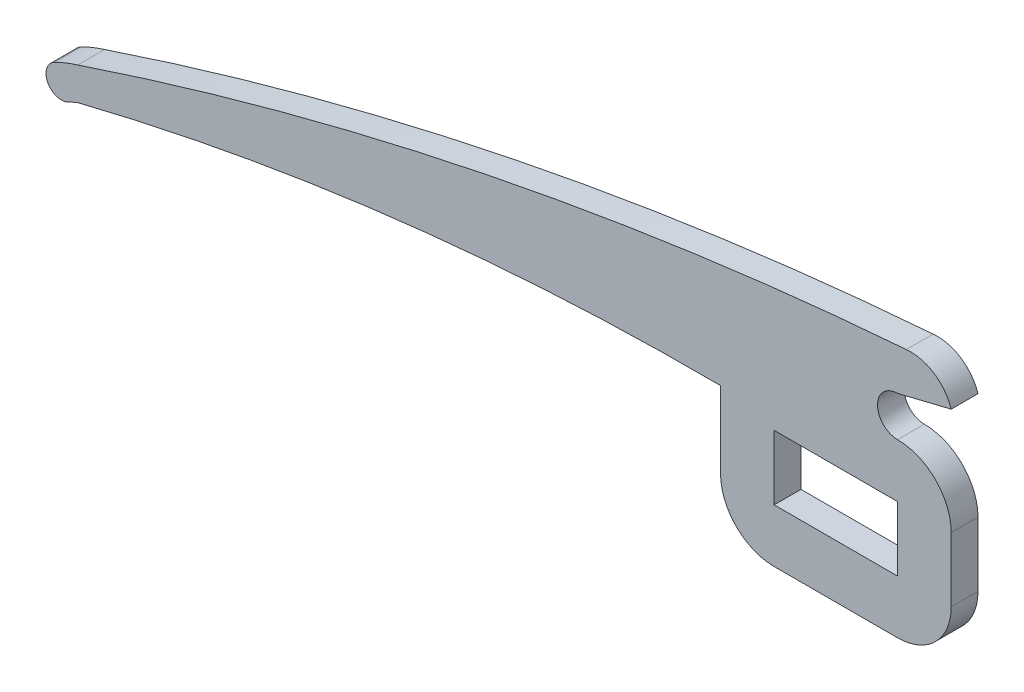
ISO-10303-21;
HEADER;
FILE_DESCRIPTION(('STEP AP214'),'2;1');
FILE_NAME('part.step','',(''),(''),'','','');
FILE_SCHEMA(('AUTOMOTIVE_DESIGN { 1 0 10303 214 1 1 1 1 }'));
ENDSEC;
DATA;
#1=APPLICATION_CONTEXT('core data for automotive mechanical design processes');
#2=APPLICATION_PROTOCOL_DEFINITION('international standard','automotive_design',2000,#1);
#3=PRODUCT_CONTEXT('',#1,'mechanical');
#4=PRODUCT('Part','Part','',(#3));
#5=PRODUCT_RELATED_PRODUCT_CATEGORY('part','',(#4));
#6=PRODUCT_DEFINITION_FORMATION('','',#4);
#7=PRODUCT_DEFINITION_CONTEXT('part definition',#1,'design');
#8=PRODUCT_DEFINITION('design','',#6,#7);
#9=PRODUCT_DEFINITION_SHAPE('','',#8);
#10=(LENGTH_UNIT() NAMED_UNIT(*) SI_UNIT(.MILLI.,.METRE.));
#11=(NAMED_UNIT(*) PLANE_ANGLE_UNIT() SI_UNIT($,.RADIAN.));
#12=(NAMED_UNIT(*) SI_UNIT($,.STERADIAN.) SOLID_ANGLE_UNIT());
#13=UNCERTAINTY_MEASURE_WITH_UNIT(LENGTH_MEASURE(1.E-05),#10,'distance_accuracy_value','');
#14=(GEOMETRIC_REPRESENTATION_CONTEXT(3) GLOBAL_UNCERTAINTY_ASSIGNED_CONTEXT((#13)) GLOBAL_UNIT_ASSIGNED_CONTEXT((#10,
#11,#12)) REPRESENTATION_CONTEXT('',''));
#15=CARTESIAN_POINT('',(0.,0.,0.));
#16=DIRECTION('',(0.,0.,1.));
#17=DIRECTION('',(1.,0.,0.));
#18=AXIS2_PLACEMENT_3D('',#15,#16,#17);
#19=CARTESIAN_POINT('',(-23.0294986436589,0.0187253464755182,5.00000000000001));
#20=DIRECTION('',(0.,0.,-1.));
#21=DIRECTION('',(-1.,0.,0.));
#22=AXIS2_PLACEMENT_3D('',#19,#20,#21);
#23=PLANE('',#22);
#24=CARTESIAN_POINT('',(-23.0294986436589,0.0187253464755182,5.00000000000001));
#25=DIRECTION('',(0.,0.,1.));
#26=DIRECTION('',(-1.,0.,0.));
#27=AXIS2_PLACEMENT_3D('',#24,#25,#26);
#28=CIRCLE('',#27,9.98825294289375);
#29=CARTESIAN_POINT('',(-33.0177515865527,0.0187253464755182,5.00000000000001));
#30=VERTEX_POINT('',#29);
#31=CARTESIAN_POINT('',(-23.0294986436589,-9.96952759641823,5.00000000000001));
#32=VERTEX_POINT('',#31);
#33=EDGE_CURVE('E195',#30,#32,#28,.T.);
#34=ORIENTED_EDGE('',*,*,#33,.T.);
#35=DIRECTION('',(1.,0.,0.));
#36=VECTOR('',#35,1.);
#37=CARTESIAN_POINT('',(-23.0294986436589,-9.96952759641823,5.00000000000001));
#38=LINE('',#37,#36);
#39=CARTESIAN_POINT('',(0.0200590351698439,-9.96952759641824,5.00000000000001));
#40=VERTEX_POINT('',#39);
#41=EDGE_CURVE('E198',#32,#40,#38,.T.);
#42=ORIENTED_EDGE('',*,*,#41,.T.);
#43=CARTESIAN_POINT('',(0.0200590351698421,0.0200440340774669,5.00000000000001));
#44=DIRECTION('',(0.,0.,1.));
#45=DIRECTION('',(-1.,0.,0.));
#46=AXIS2_PLACEMENT_3D('',#43,#44,#45);
#47=CIRCLE('',#46,9.9895716304957);
#48=CARTESIAN_POINT('',(10.0096306656655,0.0200437648131177,5.00000000000001));
#49=VERTEX_POINT('',#48);
#50=EDGE_CURVE('E201',#40,#49,#47,.T.);
#51=ORIENTED_EDGE('',*,*,#50,.T.);
#52=DIRECTION('',(0.,1.,0.));
#53=VECTOR('',#52,1.);
#54=CARTESIAN_POINT('',(10.0096306656655,12.0354295052616,5.00000000000001));
#55=LINE('',#54,#53);
#56=CARTESIAN_POINT('',(10.0096306656655,12.0354295052616,5.00000000000001));
#57=VERTEX_POINT('',#56);
#58=EDGE_CURVE('E203',#49,#57,#55,.T.);
#59=ORIENTED_EDGE('',*,*,#58,.T.);
#60=CARTESIAN_POINT('',(0.00232147007218474,12.0331080349892,5.00000000000001));
#61=DIRECTION('',(0.,0.,1.));
#62=DIRECTION('',(-1.,0.,0.));
#63=AXIS2_PLACEMENT_3D('',#60,#61,#62);
#64=CIRCLE('',#63,10.0073094648578);
#65=CARTESIAN_POINT('',(0.00232147007218495,22.0404174998469,5.00000000000001));
#66=VERTEX_POINT('',#65);
#67=EDGE_CURVE('E205',#57,#66,#64,.T.);
#68=ORIENTED_EDGE('',*,*,#67,.T.);
#69=CARTESIAN_POINT('',(0.00232147007218232,25.7769746913497,5.00000000000001));
#70=DIRECTION('',(0.,0.,-1.));
#71=DIRECTION('',(1.,0.,0.));
#72=AXIS2_PLACEMENT_3D('',#69,#70,#71);
#73=CIRCLE('',#72,3.73655719150275);
#74=CARTESIAN_POINT('',(0.00232147007218474,29.5135318828524,5.00000000000001));
#75=VERTEX_POINT('',#74);
#76=EDGE_CURVE('E207',#66,#75,#73,.T.);
#77=ORIENTED_EDGE('',*,*,#76,.T.);
#78=DIRECTION('',(0.971260967002743,0.238017087573342,0.));
#79=VECTOR('',#78,1.);
#80=CARTESIAN_POINT('',(10.0096306656655,31.9659217863935,5.00000000000001));
#81=LINE('',#80,#79);
#82=CARTESIAN_POINT('',(10.0096306656655,31.9659217863935,5.00000000000001));
#83=VERTEX_POINT('',#82);
#84=EDGE_CURVE('E209',#75,#83,#81,.T.);
#85=ORIENTED_EDGE('',*,*,#84,.T.);
#86=CARTESIAN_POINT('',(2.45471137361272,29.5135318828524,5.00000000000001));
#87=DIRECTION('',(0.,0.,1.));
#88=DIRECTION('',(-1.,0.,0.));
#89=AXIS2_PLACEMENT_3D('',#86,#87,#88);
#90=CIRCLE('',#89,7.94298569483932);
#91=CARTESIAN_POINT('',(1.63153585656594,37.4137473113427,5.00000000000001));
#92=VERTEX_POINT('',#91);
#93=EDGE_CURVE('E211',#83,#92,#90,.T.);
#94=ORIENTED_EDGE('',*,*,#93,.T.);
#95=CARTESIAN_POINT('',(50.6287042659373,-601.67086758297,5.00000000000001));
#96=DIRECTION('',(0.,0.,1.));
#97=DIRECTION('',(-1.,0.,0.));
#98=AXIS2_PLACEMENT_3D('',#95,#96,#97);
#99=CIRCLE('',#98,640.960113818909);
#100=CARTESIAN_POINT('',(-152.922807066753,6.10923224008788,5.00000000000001));
#101=VERTEX_POINT('',#100);
#102=EDGE_CURVE('E213',#92,#101,#99,.T.);
#103=ORIENTED_EDGE('',*,*,#102,.T.);
#104=CARTESIAN_POINT('',(-144.895449134273,-20.1016774209472,5.00000000000001));
#105=DIRECTION('',(0.,0.,1.));
#106=DIRECTION('',(1.,0.,0.));
#107=AXIS2_PLACEMENT_3D('',#104,#105,#106);
#108=CIRCLE('',#107,27.412593103081);
#109=CARTESIAN_POINT('',(-157.265351369066,4.36126964878941,5.00000000000001));
#110=VERTEX_POINT('',#109);
#111=EDGE_CURVE('E215',#101,#110,#108,.T.);
#112=ORIENTED_EDGE('',*,*,#111,.T.);
#113=CARTESIAN_POINT('',(-155.968002489383,1.79560854878484,5.00000000000001));
#114=DIRECTION('',(0.,0.,1.));
#115=DIRECTION('',(1.,0.,0.));
#116=AXIS2_PLACEMENT_3D('',#113,#114,#115);
#117=CIRCLE('',#116,2.87501843397422);
#118=CARTESIAN_POINT('',(-154.6706536097,-0.770052551219726,5.00000000000001));
#119=VERTEX_POINT('',#118);
#120=EDGE_CURVE('E217',#110,#119,#117,.T.);
#121=ORIENTED_EDGE('',*,*,#120,.T.);
#122=CARTESIAN_POINT('',(-144.888159070749,-20.1160943851825,5.00000000000001));
#123=DIRECTION('',(0.,0.,-1.));
#124=DIRECTION('',(-1.,0.,0.));
#125=AXIS2_PLACEMENT_3D('',#122,#123,#124);
#126=CIRCLE('',#125,21.6787115402656);
#127=CARTESIAN_POINT('',(-152.922807066753,0.0187253464755122,5.00000000000001));
#128=VERTEX_POINT('',#127);
#129=EDGE_CURVE('E219',#119,#128,#126,.T.);
#130=ORIENTED_EDGE('',*,*,#129,.T.);
#131=CARTESIAN_POINT('',(-36.4351616334843,-468.822459355462,5.00000000000001));
#132=DIRECTION('',(0.,0.,-1.));
#133=DIRECTION('',(-1.,0.,0.));
#134=AXIS2_PLACEMENT_3D('',#131,#132,#133);
#135=CIRCLE('',#134,483.09567169589);
#136=CARTESIAN_POINT('',(-33.0177515865527,14.2611248407662,5.00000000000001));
#137=VERTEX_POINT('',#136);
#138=EDGE_CURVE('E221',#128,#137,#135,.T.);
#139=ORIENTED_EDGE('',*,*,#138,.T.);
#140=DIRECTION('',(0.,-1.,0.));
#141=VECTOR('',#140,1.);
#142=CARTESIAN_POINT('',(-33.0177515865527,12.0354297745259,5.00000000000001));
#143=LINE('',#142,#141);
#144=EDGE_CURVE('E223',#137,#30,#143,.T.);
#145=ORIENTED_EDGE('',*,*,#144,.T.);
#146=EDGE_LOOP('',(#34,#42,#51,#59,#68,#77,#85,#94,#103,#112,#121,#130,#139,#145));
#147=FACE_BOUND('',#146,.T.);
#148=DIRECTION('',(0.,1.,0.));
#149=VECTOR('',#148,1.);
#150=CARTESIAN_POINT('',(0.,12.0354297745259,5.00000000000001));
#151=LINE('',#150,#149);
#152=CARTESIAN_POINT('',(0.,0.,5.00000000000001));
#153=VERTEX_POINT('',#152);
#154=CARTESIAN_POINT('',(0.,12.0354297745259,5.00000000000001));
#155=VERTEX_POINT('',#154);
#156=EDGE_CURVE('E159',#153,#155,#151,.T.);
#157=ORIENTED_EDGE('',*,*,#156,.F.);
#158=DIRECTION('',(1.,0.,0.));
#159=VECTOR('',#158,1.);
#160=CARTESIAN_POINT('',(0.,0.,5.00000000000001));
#161=LINE('',#160,#159);
#162=CARTESIAN_POINT('',(-23.0107908497502,0.,5.00000000000001));
#163=VERTEX_POINT('',#162);
#164=EDGE_CURVE('E181',#163,#153,#161,.T.);
#165=ORIENTED_EDGE('',*,*,#164,.F.);
#166=DIRECTION('',(0.,-1.,0.));
#167=VECTOR('',#166,1.);
#168=CARTESIAN_POINT('',(-23.0107908497502,0.,5.00000000000001));
#169=LINE('',#168,#167);
#170=CARTESIAN_POINT('',(-23.0107908497502,12.0354297745259,5.00000000000001));
#171=VERTEX_POINT('',#170);
#172=EDGE_CURVE('E179',#171,#163,#169,.T.);
#173=ORIENTED_EDGE('',*,*,#172,.F.);
#174=DIRECTION('',(-1.,0.,0.));
#175=VECTOR('',#174,1.);
#176=CARTESIAN_POINT('',(-23.0107908497502,12.0354297745259,5.00000000000001));
#177=LINE('',#176,#175);
#178=EDGE_CURVE('E167',#155,#171,#177,.T.);
#179=ORIENTED_EDGE('',*,*,#178,.F.);
#180=EDGE_LOOP('',(#157,#165,#173,#179));
#181=FACE_BOUND('',#180,.T.);
#182=ADVANCED_FACE('F34',(#147,#181),#23,.F.);
#183=CARTESIAN_POINT('',(-23.0294986436589,0.0187253464755182,0.));
#184=DIRECTION('',(0.,0.,-1.));
#185=DIRECTION('',(-1.,0.,0.));
#186=AXIS2_PLACEMENT_3D('',#183,#184,#185);
#187=PLANE('',#186);
#188=CARTESIAN_POINT('',(-23.0294986436589,0.0187253464755182,0.));
#189=DIRECTION('',(0.,0.,1.));
#190=DIRECTION('',(-1.,0.,0.));
#191=AXIS2_PLACEMENT_3D('',#188,#189,#190);
#192=CIRCLE('',#191,9.98825294289375);
#193=CARTESIAN_POINT('',(-33.0177515865527,0.0187253464755182,0.));
#194=VERTEX_POINT('',#193);
#195=CARTESIAN_POINT('',(-23.0294986436589,-9.96952759641823,0.));
#196=VERTEX_POINT('',#195);
#197=EDGE_CURVE('E175',#194,#196,#192,.T.);
#198=ORIENTED_EDGE('',*,*,#197,.F.);
#199=DIRECTION('',(0.,-1.,0.));
#200=VECTOR('',#199,1.);
#201=CARTESIAN_POINT('',(-33.0177515865527,12.0354297745259,0.));
#202=LINE('',#201,#200);
#203=CARTESIAN_POINT('',(-33.0177515865527,14.2611248407662,0.));
#204=VERTEX_POINT('',#203);
#205=EDGE_CURVE('E199',#204,#194,#202,.T.);
#206=ORIENTED_EDGE('',*,*,#205,.F.);
#207=CARTESIAN_POINT('',(-36.4351616334843,-468.822459355462,0.));
#208=DIRECTION('',(0.,0.,-1.));
#209=DIRECTION('',(-1.,0.,0.));
#210=AXIS2_PLACEMENT_3D('',#207,#208,#209);
#211=CIRCLE('',#210,483.09567169589);
#212=CARTESIAN_POINT('',(-152.922807066753,0.0187253464755122,0.));
#213=VERTEX_POINT('',#212);
#214=EDGE_CURVE('E250',#213,#204,#211,.T.);
#215=ORIENTED_EDGE('',*,*,#214,.F.);
#216=CARTESIAN_POINT('',(-144.888159070749,-20.1160943851825,0.));
#217=DIRECTION('',(0.,0.,-1.));
#218=DIRECTION('',(-1.,0.,0.));
#219=AXIS2_PLACEMENT_3D('',#216,#217,#218);
#220=CIRCLE('',#219,21.6787115402656);
#221=CARTESIAN_POINT('',(-154.6706536097,-0.770052551219726,0.));
#222=VERTEX_POINT('',#221);
#223=EDGE_CURVE('E248',#222,#213,#220,.T.);
#224=ORIENTED_EDGE('',*,*,#223,.F.);
#225=CARTESIAN_POINT('',(-155.968002489383,1.79560854878484,0.));
#226=DIRECTION('',(0.,0.,1.));
#227=DIRECTION('',(1.,0.,0.));
#228=AXIS2_PLACEMENT_3D('',#225,#226,#227);
#229=CIRCLE('',#228,2.87501843397422);
#230=CARTESIAN_POINT('',(-157.265351369066,4.36126964878941,0.));
#231=VERTEX_POINT('',#230);
#232=EDGE_CURVE('E246',#231,#222,#229,.T.);
#233=ORIENTED_EDGE('',*,*,#232,.F.);
#234=CARTESIAN_POINT('',(-144.895449134273,-20.1016774209472,0.));
#235=DIRECTION('',(0.,0.,1.));
#236=DIRECTION('',(1.,0.,0.));
#237=AXIS2_PLACEMENT_3D('',#234,#235,#236);
#238=CIRCLE('',#237,27.412593103081);
#239=CARTESIAN_POINT('',(-152.922807066753,6.10923224008788,0.));
#240=VERTEX_POINT('',#239);
#241=EDGE_CURVE('E244',#240,#231,#238,.T.);
#242=ORIENTED_EDGE('',*,*,#241,.F.);
#243=CARTESIAN_POINT('',(50.6287042659373,-601.67086758297,0.));
#244=DIRECTION('',(0.,0.,1.));
#245=DIRECTION('',(-1.,0.,0.));
#246=AXIS2_PLACEMENT_3D('',#243,#244,#245);
#247=CIRCLE('',#246,640.960113818909);
#248=CARTESIAN_POINT('',(1.63153585656594,37.4137473113427,0.));
#249=VERTEX_POINT('',#248);
#250=EDGE_CURVE('E242',#249,#240,#247,.T.);
#251=ORIENTED_EDGE('',*,*,#250,.F.);
#252=CARTESIAN_POINT('',(2.45471137361272,29.5135318828524,0.));
#253=DIRECTION('',(0.,0.,1.));
#254=DIRECTION('',(-1.,0.,0.));
#255=AXIS2_PLACEMENT_3D('',#252,#253,#254);
#256=CIRCLE('',#255,7.94298569483932);
#257=CARTESIAN_POINT('',(10.0096306656655,31.9659217863935,0.));
#258=VERTEX_POINT('',#257);
#259=EDGE_CURVE('E240',#258,#249,#256,.T.);
#260=ORIENTED_EDGE('',*,*,#259,.F.);
#261=DIRECTION('',(0.971260967002743,0.238017087573342,0.));
#262=VECTOR('',#261,1.);
#263=CARTESIAN_POINT('',(10.0096306656655,31.9659217863935,0.));
#264=LINE('',#263,#262);
#265=CARTESIAN_POINT('',(0.00232147007218474,29.5135318828524,0.));
#266=VERTEX_POINT('',#265);
#267=EDGE_CURVE('E238',#266,#258,#264,.T.);
#268=ORIENTED_EDGE('',*,*,#267,.F.);
#269=CARTESIAN_POINT('',(0.00232147007218232,25.7769746913497,0.));
#270=DIRECTION('',(0.,0.,-1.));
#271=DIRECTION('',(1.,0.,0.));
#272=AXIS2_PLACEMENT_3D('',#269,#270,#271);
#273=CIRCLE('',#272,3.73655719150275);
#274=CARTESIAN_POINT('',(0.00232147007218495,22.0404174998469,0.));
#275=VERTEX_POINT('',#274);
#276=EDGE_CURVE('E236',#275,#266,#273,.T.);
#277=ORIENTED_EDGE('',*,*,#276,.F.);
#278=CARTESIAN_POINT('',(0.00232147007218474,12.0331080349892,0.));
#279=DIRECTION('',(0.,0.,1.));
#280=DIRECTION('',(-1.,0.,0.));
#281=AXIS2_PLACEMENT_3D('',#278,#279,#280);
#282=CIRCLE('',#281,10.0073094648578);
#283=CARTESIAN_POINT('',(10.0096306656655,12.0354295052616,0.));
#284=VERTEX_POINT('',#283);
#285=EDGE_CURVE('E234',#284,#275,#282,.T.);
#286=ORIENTED_EDGE('',*,*,#285,.F.);
#287=DIRECTION('',(0.,1.,0.));
#288=VECTOR('',#287,1.);
#289=CARTESIAN_POINT('',(10.0096306656655,12.0354295052616,0.));
#290=LINE('',#289,#288);
#291=CARTESIAN_POINT('',(10.0096306656655,0.0200437648131177,0.));
#292=VERTEX_POINT('',#291);
#293=EDGE_CURVE('E232',#292,#284,#290,.T.);
#294=ORIENTED_EDGE('',*,*,#293,.F.);
#295=CARTESIAN_POINT('',(0.0200590351698421,0.0200440340774669,0.));
#296=DIRECTION('',(0.,0.,1.));
#297=DIRECTION('',(-1.,0.,0.));
#298=AXIS2_PLACEMENT_3D('',#295,#296,#297);
#299=CIRCLE('',#298,9.9895716304957);
#300=CARTESIAN_POINT('',(0.0200590351698439,-9.96952759641824,0.));
#301=VERTEX_POINT('',#300);
#302=EDGE_CURVE('E230',#301,#292,#299,.T.);
#303=ORIENTED_EDGE('',*,*,#302,.F.);
#304=DIRECTION('',(1.,0.,0.));
#305=VECTOR('',#304,1.);
#306=CARTESIAN_POINT('',(-23.0294986436589,-9.96952759641823,0.));
#307=LINE('',#306,#305);
#308=EDGE_CURVE('E228',#196,#301,#307,.T.);
#309=ORIENTED_EDGE('',*,*,#308,.F.);
#310=EDGE_LOOP('',(#198,#206,#215,#224,#233,#242,#251,#260,#268,#277,#286,#294,#303,#309));
#311=FACE_BOUND('',#310,.T.);
#312=DIRECTION('',(1.,0.,0.));
#313=VECTOR('',#312,1.);
#314=CARTESIAN_POINT('',(0.,0.,0.));
#315=LINE('',#314,#313);
#316=CARTESIAN_POINT('',(-23.0107908497502,0.,0.));
#317=VERTEX_POINT('',#316);
#318=CARTESIAN_POINT('',(0.,0.,0.));
#319=VERTEX_POINT('',#318);
#320=EDGE_CURVE('E168',#317,#319,#315,.T.);
#321=ORIENTED_EDGE('',*,*,#320,.T.);
#322=DIRECTION('',(0.,1.,0.));
#323=VECTOR('',#322,1.);
#324=CARTESIAN_POINT('',(0.,12.0354297745259,0.));
#325=LINE('',#324,#323);
#326=CARTESIAN_POINT('',(0.,12.0354297745259,0.));
#327=VERTEX_POINT('',#326);
#328=EDGE_CURVE('E57',#319,#327,#325,.T.);
#329=ORIENTED_EDGE('',*,*,#328,.T.);
#330=DIRECTION('',(-1.,0.,0.));
#331=VECTOR('',#330,1.);
#332=CARTESIAN_POINT('',(-23.0107908497502,12.0354297745259,0.));
#333=LINE('',#332,#331);
#334=CARTESIAN_POINT('',(-23.0107908497502,12.0354297745259,0.));
#335=VERTEX_POINT('',#334);
#336=EDGE_CURVE('E174',#327,#335,#333,.T.);
#337=ORIENTED_EDGE('',*,*,#336,.T.);
#338=DIRECTION('',(0.,-1.,0.));
#339=VECTOR('',#338,1.);
#340=CARTESIAN_POINT('',(-23.0107908497502,0.,0.));
#341=LINE('',#340,#339);
#342=EDGE_CURVE('E187',#335,#317,#341,.T.);
#343=ORIENTED_EDGE('',*,*,#342,.T.);
#344=EDGE_LOOP('',(#321,#329,#337,#343));
#345=FACE_BOUND('',#344,.T.);
#346=ADVANCED_FACE('F299',(#311,#345),#187,.T.);
#347=CARTESIAN_POINT('',(-23.0294986436589,0.0187253464755182,5.00000000000001));
#348=DIRECTION('',(0.,0.,-1.));
#349=DIRECTION('',(-1.,0.,0.));
#350=AXIS2_PLACEMENT_3D('',#347,#348,#349);
#351=CYLINDRICAL_SURFACE('',#350,9.98825294289375);
#352=ORIENTED_EDGE('',*,*,#197,.T.);
#353=DIRECTION('',(0.,0.,-1.));
#354=VECTOR('',#353,1.);
#355=CARTESIAN_POINT('',(-23.0294986436589,-9.96952759641823,5.00000000000001));
#356=LINE('',#355,#354);
#357=EDGE_CURVE('E11',#32,#196,#356,.T.);
#358=ORIENTED_EDGE('',*,*,#357,.F.);
#359=ORIENTED_EDGE('',*,*,#33,.F.);
#360=DIRECTION('',(0.,0.,-1.));
#361=VECTOR('',#360,1.);
#362=CARTESIAN_POINT('',(-33.0177515865527,0.0187253464755182,5.00000000000001));
#363=LINE('',#362,#361);
#364=EDGE_CURVE('E225',#30,#194,#363,.T.);
#365=ORIENTED_EDGE('',*,*,#364,.T.);
#366=EDGE_LOOP('',(#352,#358,#359,#365));
#367=FACE_BOUND('',#366,.T.);
#368=ADVANCED_FACE('F36',(#367),#351,.T.);
#369=CARTESIAN_POINT('',(-23.0294986436589,-9.96952759641823,5.00000000000001));
#370=DIRECTION('',(0.,1.,0.));
#371=DIRECTION('',(-1.,0.,0.));
#372=AXIS2_PLACEMENT_3D('',#369,#370,#371);
#373=PLANE('',#372);
#374=ORIENTED_EDGE('',*,*,#308,.T.);
#375=DIRECTION('',(0.,0.,-1.));
#376=VECTOR('',#375,1.);
#377=CARTESIAN_POINT('',(0.0200590351698439,-9.96952759641824,5.00000000000001));
#378=LINE('',#377,#376);
#379=EDGE_CURVE('E42',#40,#301,#378,.T.);
#380=ORIENTED_EDGE('',*,*,#379,.F.);
#381=ORIENTED_EDGE('',*,*,#41,.F.);
#382=ORIENTED_EDGE('',*,*,#357,.T.);
#383=EDGE_LOOP('',(#374,#380,#381,#382));
#384=FACE_BOUND('',#383,.T.);
#385=ADVANCED_FACE('F316',(#384),#373,.F.);
#386=CARTESIAN_POINT('',(0.0200590351698421,0.0200440340774669,5.00000000000001));
#387=DIRECTION('',(0.,0.,-1.));
#388=DIRECTION('',(-1.,0.,0.));
#389=AXIS2_PLACEMENT_3D('',#386,#387,#388);
#390=CYLINDRICAL_SURFACE('',#389,9.9895716304957);
#391=ORIENTED_EDGE('',*,*,#302,.T.);
#392=DIRECTION('',(0.,0.,-1.));
#393=VECTOR('',#392,1.);
#394=CARTESIAN_POINT('',(10.0096306656655,0.0200437648131177,5.00000000000001));
#395=LINE('',#394,#393);
#396=EDGE_CURVE('E286',#49,#292,#395,.T.);
#397=ORIENTED_EDGE('',*,*,#396,.F.);
#398=ORIENTED_EDGE('',*,*,#50,.F.);
#399=ORIENTED_EDGE('',*,*,#379,.T.);
#400=EDGE_LOOP('',(#391,#397,#398,#399));
#401=FACE_BOUND('',#400,.T.);
#402=ADVANCED_FACE('F293',(#401),#390,.T.);
#403=CARTESIAN_POINT('',(10.0096306656655,12.0354295052616,5.00000000000001));
#404=DIRECTION('',(-1.,0.,0.));
#405=DIRECTION('',(0.,0.,1.));
#406=AXIS2_PLACEMENT_3D('',#403,#404,#405);
#407=PLANE('',#406);
#408=ORIENTED_EDGE('',*,*,#293,.T.);
#409=DIRECTION('',(0.,0.,-1.));
#410=VECTOR('',#409,1.);
#411=CARTESIAN_POINT('',(10.0096306656655,12.0354295052616,5.00000000000001));
#412=LINE('',#411,#410);
#413=EDGE_CURVE('E283',#57,#284,#412,.T.);
#414=ORIENTED_EDGE('',*,*,#413,.F.);
#415=ORIENTED_EDGE('',*,*,#58,.F.);
#416=ORIENTED_EDGE('',*,*,#396,.T.);
#417=EDGE_LOOP('',(#408,#414,#415,#416));
#418=FACE_BOUND('',#417,.T.);
#419=ADVANCED_FACE('F305',(#418),#407,.F.);
#420=CARTESIAN_POINT('',(0.00232147007218474,12.0331080349892,5.00000000000001));
#421=DIRECTION('',(0.,0.,-1.));
#422=DIRECTION('',(-1.,0.,0.));
#423=AXIS2_PLACEMENT_3D('',#420,#421,#422);
#424=CYLINDRICAL_SURFACE('',#423,10.0073094648578);
#425=ORIENTED_EDGE('',*,*,#285,.T.);
#426=DIRECTION('',(0.,0.,-1.));
#427=VECTOR('',#426,1.);
#428=CARTESIAN_POINT('',(0.00232147007218495,22.0404174998469,5.00000000000001));
#429=LINE('',#428,#427);
#430=EDGE_CURVE('E280',#66,#275,#429,.T.);
#431=ORIENTED_EDGE('',*,*,#430,.F.);
#432=ORIENTED_EDGE('',*,*,#67,.F.);
#433=ORIENTED_EDGE('',*,*,#413,.T.);
#434=EDGE_LOOP('',(#425,#431,#432,#433));
#435=FACE_BOUND('',#434,.T.);
#436=ADVANCED_FACE('F309',(#435),#424,.T.);
#437=CARTESIAN_POINT('',(0.00232147007218232,25.7769746913497,5.00000000000001));
#438=DIRECTION('',(0.,0.,-1.));
#439=DIRECTION('',(-1.,0.,0.));
#440=AXIS2_PLACEMENT_3D('',#437,#438,#439);
#441=CYLINDRICAL_SURFACE('',#440,3.73655719150275);
#442=ORIENTED_EDGE('',*,*,#276,.T.);
#443=DIRECTION('',(0.,0.,-1.));
#444=VECTOR('',#443,1.);
#445=CARTESIAN_POINT('',(0.00232147007218474,29.5135318828524,5.00000000000001));
#446=LINE('',#445,#444);
#447=EDGE_CURVE('E277',#75,#266,#446,.T.);
#448=ORIENTED_EDGE('',*,*,#447,.F.);
#449=ORIENTED_EDGE('',*,*,#76,.F.);
#450=ORIENTED_EDGE('',*,*,#430,.T.);
#451=EDGE_LOOP('',(#442,#448,#449,#450));
#452=FACE_BOUND('',#451,.T.);
#453=ADVANCED_FACE('F358',(#452),#441,.F.);
#454=CARTESIAN_POINT('',(10.0096306656655,31.9659217863935,5.00000000000001));
#455=DIRECTION('',(-0.238017087573342,0.971260967002743,0.));
#456=DIRECTION('',(-0.971260967002743,-0.238017087573342,0.));
#457=AXIS2_PLACEMENT_3D('',#454,#455,#456);
#458=PLANE('',#457);
#459=ORIENTED_EDGE('',*,*,#267,.T.);
#460=DIRECTION('',(0.,0.,-1.));
#461=VECTOR('',#460,1.);
#462=CARTESIAN_POINT('',(10.0096306656655,31.9659217863935,5.00000000000001));
#463=LINE('',#462,#461);
#464=EDGE_CURVE('E274',#83,#258,#463,.T.);
#465=ORIENTED_EDGE('',*,*,#464,.F.);
#466=ORIENTED_EDGE('',*,*,#84,.F.);
#467=ORIENTED_EDGE('',*,*,#447,.T.);
#468=EDGE_LOOP('',(#459,#465,#466,#467));
#469=FACE_BOUND('',#468,.T.);
#470=ADVANCED_FACE('F356',(#469),#458,.F.);
#471=CARTESIAN_POINT('',(2.45471137361272,29.5135318828524,5.00000000000001));
#472=DIRECTION('',(0.,0.,-1.));
#473=DIRECTION('',(-1.,0.,0.));
#474=AXIS2_PLACEMENT_3D('',#471,#472,#473);
#475=CYLINDRICAL_SURFACE('',#474,7.94298569483932);
#476=ORIENTED_EDGE('',*,*,#259,.T.);
#477=DIRECTION('',(0.,0.,-1.));
#478=VECTOR('',#477,1.);
#479=CARTESIAN_POINT('',(1.63153585656594,37.4137473113427,5.00000000000001));
#480=LINE('',#479,#478);
#481=EDGE_CURVE('E271',#92,#249,#480,.T.);
#482=ORIENTED_EDGE('',*,*,#481,.F.);
#483=ORIENTED_EDGE('',*,*,#93,.F.);
#484=ORIENTED_EDGE('',*,*,#464,.T.);
#485=EDGE_LOOP('',(#476,#482,#483,#484));
#486=FACE_BOUND('',#485,.T.);
#487=ADVANCED_FACE('F351',(#486),#475,.T.);
#488=CARTESIAN_POINT('',(50.6287042659373,-601.67086758297,5.00000000000001));
#489=DIRECTION('',(0.,0.,-1.));
#490=DIRECTION('',(-1.,0.,0.));
#491=AXIS2_PLACEMENT_3D('',#488,#489,#490);
#492=CYLINDRICAL_SURFACE('',#491,640.960113818909);
#493=ORIENTED_EDGE('',*,*,#250,.T.);
#494=DIRECTION('',(0.,0.,-1.));
#495=VECTOR('',#494,1.);
#496=CARTESIAN_POINT('',(-152.922807066753,6.10923224008788,5.00000000000001));
#497=LINE('',#496,#495);
#498=EDGE_CURVE('E268',#101,#240,#497,.T.);
#499=ORIENTED_EDGE('',*,*,#498,.F.);
#500=ORIENTED_EDGE('',*,*,#102,.F.);
#501=ORIENTED_EDGE('',*,*,#481,.T.);
#502=EDGE_LOOP('',(#493,#499,#500,#501));
#503=FACE_BOUND('',#502,.T.);
#504=ADVANCED_FACE('F346',(#503),#492,.T.);
#505=CARTESIAN_POINT('',(-144.895449134273,-20.1016774209472,5.00000000000001));
#506=DIRECTION('',(0.,0.,-1.));
#507=DIRECTION('',(-1.,0.,0.));
#508=AXIS2_PLACEMENT_3D('',#505,#506,#507);
#509=CYLINDRICAL_SURFACE('',#508,27.412593103081);
#510=ORIENTED_EDGE('',*,*,#241,.T.);
#511=DIRECTION('',(0.,0.,-1.));
#512=VECTOR('',#511,1.);
#513=CARTESIAN_POINT('',(-157.265351369066,4.36126964878941,5.00000000000001));
#514=LINE('',#513,#512);
#515=EDGE_CURVE('E265',#110,#231,#514,.T.);
#516=ORIENTED_EDGE('',*,*,#515,.F.);
#517=ORIENTED_EDGE('',*,*,#111,.F.);
#518=ORIENTED_EDGE('',*,*,#498,.T.);
#519=EDGE_LOOP('',(#510,#516,#517,#518));
#520=FACE_BOUND('',#519,.T.);
#521=ADVANCED_FACE('F342',(#520),#509,.T.);
#522=CARTESIAN_POINT('',(-155.968002489383,1.79560854878484,5.00000000000001));
#523=DIRECTION('',(0.,0.,-1.));
#524=DIRECTION('',(-1.,0.,0.));
#525=AXIS2_PLACEMENT_3D('',#522,#523,#524);
#526=CYLINDRICAL_SURFACE('',#525,2.87501843397422);
#527=ORIENTED_EDGE('',*,*,#232,.T.);
#528=DIRECTION('',(0.,0.,-1.));
#529=VECTOR('',#528,1.);
#530=CARTESIAN_POINT('',(-154.6706536097,-0.770052551219726,5.00000000000001));
#531=LINE('',#530,#529);
#532=EDGE_CURVE('E262',#119,#222,#531,.T.);
#533=ORIENTED_EDGE('',*,*,#532,.F.);
#534=ORIENTED_EDGE('',*,*,#120,.F.);
#535=ORIENTED_EDGE('',*,*,#515,.T.);
#536=EDGE_LOOP('',(#527,#533,#534,#535));
#537=FACE_BOUND('',#536,.T.);
#538=ADVANCED_FACE('F338',(#537),#526,.T.);
#539=CARTESIAN_POINT('',(-144.888159070749,-20.1160943851825,5.00000000000001));
#540=DIRECTION('',(0.,0.,-1.));
#541=DIRECTION('',(-1.,0.,0.));
#542=AXIS2_PLACEMENT_3D('',#539,#540,#541);
#543=CYLINDRICAL_SURFACE('',#542,21.6787115402656);
#544=ORIENTED_EDGE('',*,*,#223,.T.);
#545=DIRECTION('',(0.,0.,-1.));
#546=VECTOR('',#545,1.);
#547=CARTESIAN_POINT('',(-152.922807066753,0.0187253464755122,5.00000000000001));
#548=LINE('',#547,#546);
#549=EDGE_CURVE('E259',#128,#213,#548,.T.);
#550=ORIENTED_EDGE('',*,*,#549,.F.);
#551=ORIENTED_EDGE('',*,*,#129,.F.);
#552=ORIENTED_EDGE('',*,*,#532,.T.);
#553=EDGE_LOOP('',(#544,#550,#551,#552));
#554=FACE_BOUND('',#553,.T.);
#555=ADVANCED_FACE('F333',(#554),#543,.F.);
#556=CARTESIAN_POINT('',(-36.4351616334843,-468.822459355462,5.00000000000001));
#557=DIRECTION('',(0.,0.,-1.));
#558=DIRECTION('',(-1.,0.,0.));
#559=AXIS2_PLACEMENT_3D('',#556,#557,#558);
#560=CYLINDRICAL_SURFACE('',#559,483.09567169589);
#561=ORIENTED_EDGE('',*,*,#214,.T.);
#562=DIRECTION('',(0.,0.,-1.));
#563=VECTOR('',#562,1.);
#564=CARTESIAN_POINT('',(-33.0177515865527,14.2611248407662,5.00000000000001));
#565=LINE('',#564,#563);
#566=EDGE_CURVE('E256',#137,#204,#565,.T.);
#567=ORIENTED_EDGE('',*,*,#566,.F.);
#568=ORIENTED_EDGE('',*,*,#138,.F.);
#569=ORIENTED_EDGE('',*,*,#549,.T.);
#570=EDGE_LOOP('',(#561,#567,#568,#569));
#571=FACE_BOUND('',#570,.T.);
#572=ADVANCED_FACE('F324',(#571),#560,.F.);
#573=CARTESIAN_POINT('',(-33.0177515865527,12.0354297745259,5.00000000000001));
#574=DIRECTION('',(1.,0.,0.));
#575=DIRECTION('',(0.,0.,-1.));
#576=AXIS2_PLACEMENT_3D('',#573,#574,#575);
#577=PLANE('',#576);
#578=ORIENTED_EDGE('',*,*,#205,.T.);
#579=ORIENTED_EDGE('',*,*,#364,.F.);
#580=ORIENTED_EDGE('',*,*,#144,.F.);
#581=ORIENTED_EDGE('',*,*,#566,.T.);
#582=EDGE_LOOP('',(#578,#579,#580,#581));
#583=FACE_BOUND('',#582,.T.);
#584=ADVANCED_FACE('F328',(#583),#577,.F.);
#585=CARTESIAN_POINT('',(0.,12.0354297745259,5.00000000000001));
#586=DIRECTION('',(-1.,0.,0.));
#587=DIRECTION('',(0.,0.,1.));
#588=AXIS2_PLACEMENT_3D('',#585,#586,#587);
#589=PLANE('',#588);
#590=ORIENTED_EDGE('',*,*,#328,.F.);
#591=DIRECTION('',(0.,0.,-1.));
#592=VECTOR('',#591,1.);
#593=CARTESIAN_POINT('',(0.,0.,5.00000000000001));
#594=LINE('',#593,#592);
#595=EDGE_CURVE('E163',#153,#319,#594,.T.);
#596=ORIENTED_EDGE('',*,*,#595,.F.);
#597=ORIENTED_EDGE('',*,*,#156,.T.);
#598=DIRECTION('',(0.,0.,-1.));
#599=VECTOR('',#598,1.);
#600=CARTESIAN_POINT('',(0.,12.0354297745259,5.00000000000001));
#601=LINE('',#600,#599);
#602=EDGE_CURVE('E162',#155,#327,#601,.T.);
#603=ORIENTED_EDGE('',*,*,#602,.T.);
#604=EDGE_LOOP('',(#590,#596,#597,#603));
#605=FACE_BOUND('',#604,.T.);
#606=ADVANCED_FACE('F161',(#605),#589,.T.);
#607=CARTESIAN_POINT('',(-23.0107908497502,12.0354297745259,5.00000000000001));
#608=DIRECTION('',(0.,-1.,0.));
#609=DIRECTION('',(1.,0.,0.));
#610=AXIS2_PLACEMENT_3D('',#607,#608,#609);
#611=PLANE('',#610);
#612=ORIENTED_EDGE('',*,*,#336,.F.);
#613=ORIENTED_EDGE('',*,*,#602,.F.);
#614=ORIENTED_EDGE('',*,*,#178,.T.);
#615=DIRECTION('',(0.,0.,-1.));
#616=VECTOR('',#615,1.);
#617=CARTESIAN_POINT('',(-23.0107908497502,12.0354297745259,5.00000000000001));
#618=LINE('',#617,#616);
#619=EDGE_CURVE('E176',#171,#335,#618,.T.);
#620=ORIENTED_EDGE('',*,*,#619,.T.);
#621=EDGE_LOOP('',(#612,#613,#614,#620));
#622=FACE_BOUND('',#621,.T.);
#623=ADVANCED_FACE('F171',(#622),#611,.T.);
#624=CARTESIAN_POINT('',(-23.0107908497502,0.,5.00000000000001));
#625=DIRECTION('',(1.,0.,0.));
#626=DIRECTION('',(0.,0.,-1.));
#627=AXIS2_PLACEMENT_3D('',#624,#625,#626);
#628=PLANE('',#627);
#629=ORIENTED_EDGE('',*,*,#342,.F.);
#630=ORIENTED_EDGE('',*,*,#619,.F.);
#631=ORIENTED_EDGE('',*,*,#172,.T.);
#632=DIRECTION('',(0.,0.,-1.));
#633=VECTOR('',#632,1.);
#634=CARTESIAN_POINT('',(-23.0107908497502,0.,5.00000000000001));
#635=LINE('',#634,#633);
#636=EDGE_CURVE('E49',#163,#317,#635,.T.);
#637=ORIENTED_EDGE('',*,*,#636,.T.);
#638=EDGE_LOOP('',(#629,#630,#631,#637));
#639=FACE_BOUND('',#638,.T.);
#640=ADVANCED_FACE('F428',(#639),#628,.T.);
#641=CARTESIAN_POINT('',(0.,0.,5.00000000000001));
#642=DIRECTION('',(0.,1.,0.));
#643=DIRECTION('',(-1.,0.,0.));
#644=AXIS2_PLACEMENT_3D('',#641,#642,#643);
#645=PLANE('',#644);
#646=ORIENTED_EDGE('',*,*,#320,.F.);
#647=ORIENTED_EDGE('',*,*,#636,.F.);
#648=ORIENTED_EDGE('',*,*,#164,.T.);
#649=ORIENTED_EDGE('',*,*,#595,.T.);
#650=EDGE_LOOP('',(#646,#647,#648,#649));
#651=FACE_BOUND('',#650,.T.);
#652=ADVANCED_FACE('F434',(#651),#645,.T.);
#653=CLOSED_SHELL('',(#182,#346,#368,#385,#402,#419,#436,#453,#470,#487,#504,#521,#538,#555,
#572,#584,#606,#623,#640,#652));
#654=MANIFOLD_SOLID_BREP('B2',#653);
#655=ADVANCED_BREP_SHAPE_REPRESENTATION('',(#18,#654),#14);
#656=SHAPE_DEFINITION_REPRESENTATION(#9,#655);
ENDSEC;
END-ISO-10303-21;
